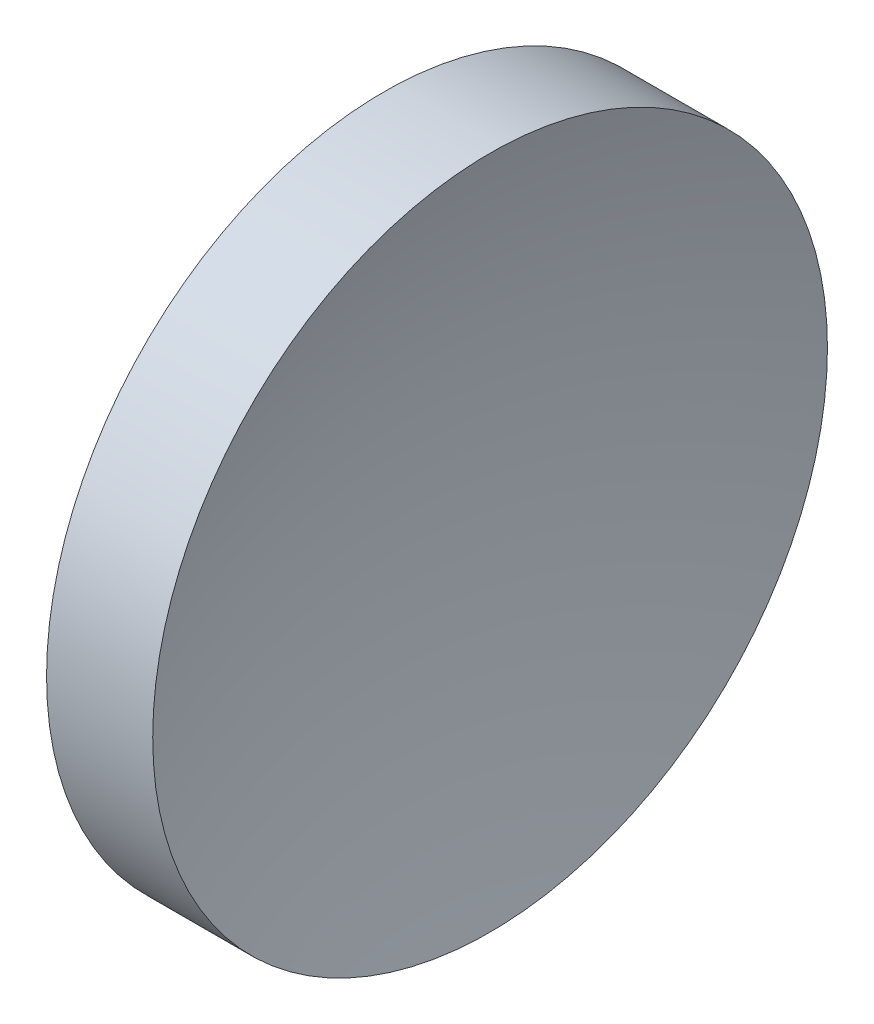
ISO-10303-21;
HEADER;
FILE_DESCRIPTION(('STEP AP214'),'2;1');
FILE_NAME('part.step','',(''),(''),'','','');
FILE_SCHEMA(('AUTOMOTIVE_DESIGN { 1 0 10303 214 1 1 1 1 }'));
ENDSEC;
DATA;
#1=APPLICATION_CONTEXT('core data for automotive mechanical design processes');
#2=APPLICATION_PROTOCOL_DEFINITION('international standard','automotive_design',2000,#1);
#3=PRODUCT_CONTEXT('',#1,'mechanical');
#4=PRODUCT('Part','Part','',(#3));
#5=PRODUCT_RELATED_PRODUCT_CATEGORY('part','',(#4));
#6=PRODUCT_DEFINITION_FORMATION('','',#4);
#7=PRODUCT_DEFINITION_CONTEXT('part definition',#1,'design');
#8=PRODUCT_DEFINITION('design','',#6,#7);
#9=PRODUCT_DEFINITION_SHAPE('','',#8);
#10=(LENGTH_UNIT() NAMED_UNIT(*) SI_UNIT(.MILLI.,.METRE.));
#11=(NAMED_UNIT(*) PLANE_ANGLE_UNIT() SI_UNIT($,.RADIAN.));
#12=(NAMED_UNIT(*) SI_UNIT($,.STERADIAN.) SOLID_ANGLE_UNIT());
#13=UNCERTAINTY_MEASURE_WITH_UNIT(LENGTH_MEASURE(1.E-05),#10,'distance_accuracy_value','');
#14=(GEOMETRIC_REPRESENTATION_CONTEXT(3) GLOBAL_UNCERTAINTY_ASSIGNED_CONTEXT((#13)) GLOBAL_UNIT_ASSIGNED_CONTEXT((#10,
#11,#12)) REPRESENTATION_CONTEXT('',''));
#15=CARTESIAN_POINT('',(0.,0.,0.));
#16=DIRECTION('',(0.,0.,1.));
#17=DIRECTION('',(1.,0.,0.));
#18=AXIS2_PLACEMENT_3D('',#15,#16,#17);
#19=CARTESIAN_POINT('',(100.832335424216,32.6107681292268,0.0115973450347182));
#20=DIRECTION('',(0.,-1.,0.));
#21=DIRECTION('',(0.,0.,1.));
#22=AXIS2_PLACEMENT_3D('',#19,#20,#21);
#23=CIRCLE('',#22,41.3);
#24=TRIMMED_CURVE('',#23,(PARAMETER_VALUE(-1.57107713418442)),
(PARAMETER_VALUE(1.57107713418442)),.T.,.PARAMETER.);
#25=CARTESIAN_POINT('',(100.832335424216,32.6107681292268,0.));
#26=DIRECTION('',(-1.,0.,0.));
#27=AXIS1_PLACEMENT('',#25,#26);
#28=SURFACE_OF_REVOLUTION('',#24,#27);
#29=CARTESIAN_POINT('',(61.4657277582327,32.6107681292268,0.));
#30=DIRECTION('',(-1.,0.,0.));
#31=DIRECTION('',(0.,0.,1.));
#32=AXIS2_PLACEMENT_3D('',#29,#30,#31);
#33=CIRCLE('',#32,12.5);
#34=CARTESIAN_POINT('',(61.4657277582327,32.6107681292268,12.5));
#35=VERTEX_POINT('',#34);
#36=EDGE_CURVE('E11',#35,#35,#33,.T.);
#37=ORIENTED_EDGE('',*,*,#36,.F.);
#38=EDGE_LOOP('',(#37));
#39=FACE_BOUND('',#38,.T.);
#40=CARTESIAN_POINT('',(59.5323370525261,32.6107681292268,0.));
#41=VERTEX_POINT('',#40);
#42=VERTEX_LOOP('',#41);
#43=FACE_BOUND('',#42,.T.);
#44=ADVANCED_FACE('F37',(#39,#43),#28,.F.);
#45=CARTESIAN_POINT('',(56.1009150799972,32.6107681292268,0.));
#46=DIRECTION('',(-1.,0.,0.));
#47=DIRECTION('',(0.,0.,1.));
#48=AXIS2_PLACEMENT_3D('',#45,#46,#47);
#49=CYLINDRICAL_SURFACE('',#48,12.5);
#50=CARTESIAN_POINT('',(57.5323370525261,32.6107681292268,0.));
#51=DIRECTION('',(-1.,0.,0.));
#52=DIRECTION('',(0.,0.,1.));
#53=AXIS2_PLACEMENT_3D('',#50,#51,#52);
#54=CIRCLE('',#53,12.5);
#55=CARTESIAN_POINT('',(57.5323370525261,32.6107681292268,12.5));
#56=VERTEX_POINT('',#55);
#57=EDGE_CURVE('E43',#56,#56,#54,.T.);
#58=ORIENTED_EDGE('',*,*,#57,.F.);
#59=EDGE_LOOP('',(#58));
#60=FACE_BOUND('',#59,.T.);
#61=ORIENTED_EDGE('',*,*,#36,.T.);
#62=EDGE_LOOP('',(#61));
#63=FACE_BOUND('',#62,.T.);
#64=ADVANCED_FACE('F47',(#60,#63),#49,.T.);
#65=CARTESIAN_POINT('',(57.5323370525261,32.6107681292268,0.));
#66=DIRECTION('',(1.,0.,0.));
#67=DIRECTION('',(0.,0.,-1.));
#68=AXIS2_PLACEMENT_3D('',#65,#66,#67);
#69=PLANE('',#68);
#70=ORIENTED_EDGE('',*,*,#57,.T.);
#71=EDGE_LOOP('',(#70));
#72=FACE_BOUND('',#71,.T.);
#73=ADVANCED_FACE('F52',(#72),#69,.F.);
#74=CLOSED_SHELL('',(#44,#64,#73));
#75=MANIFOLD_SOLID_BREP('B2',#74);
#76=ADVANCED_BREP_SHAPE_REPRESENTATION('',(#18,#75),#14);
#77=SHAPE_DEFINITION_REPRESENTATION(#9,#76);
ENDSEC;
END-ISO-10303-21;
